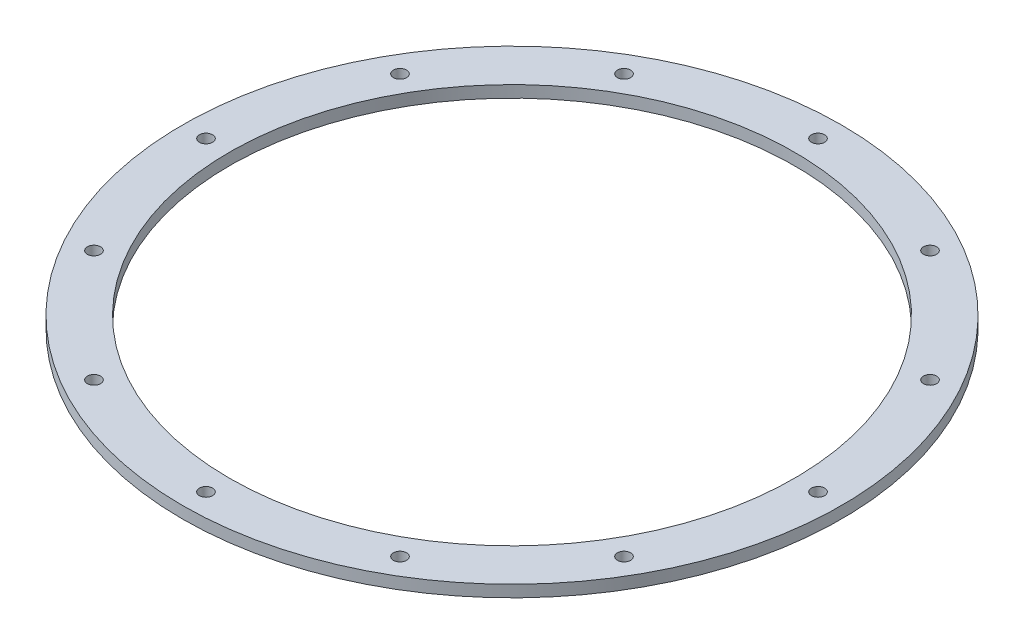
ISO-10303-21;
HEADER;
FILE_DESCRIPTION(('STEP AP214'),'2;1');
FILE_NAME('part.step','',(''),(''),'','','');
FILE_SCHEMA(('AUTOMOTIVE_DESIGN { 1 0 10303 214 1 1 1 1 }'));
ENDSEC;
DATA;
#1=APPLICATION_CONTEXT('core data for automotive mechanical design processes');
#2=APPLICATION_PROTOCOL_DEFINITION('international standard','automotive_design',2000,#1);
#3=PRODUCT_CONTEXT('',#1,'mechanical');
#4=PRODUCT('Part','Part','',(#3));
#5=PRODUCT_RELATED_PRODUCT_CATEGORY('part','',(#4));
#6=PRODUCT_DEFINITION_FORMATION('','',#4);
#7=PRODUCT_DEFINITION_CONTEXT('part definition',#1,'design');
#8=PRODUCT_DEFINITION('design','',#6,#7);
#9=PRODUCT_DEFINITION_SHAPE('','',#8);
#10=(LENGTH_UNIT() NAMED_UNIT(*) SI_UNIT(.MILLI.,.METRE.));
#11=(NAMED_UNIT(*) PLANE_ANGLE_UNIT() SI_UNIT($,.RADIAN.));
#12=(NAMED_UNIT(*) SI_UNIT($,.STERADIAN.) SOLID_ANGLE_UNIT());
#13=UNCERTAINTY_MEASURE_WITH_UNIT(LENGTH_MEASURE(1.E-05),#10,'distance_accuracy_value','');
#14=(GEOMETRIC_REPRESENTATION_CONTEXT(3) GLOBAL_UNCERTAINTY_ASSIGNED_CONTEXT((#13)) GLOBAL_UNIT_ASSIGNED_CONTEXT((#10,
#11,#12)) REPRESENTATION_CONTEXT('',''));
#15=CARTESIAN_POINT('',(0.,0.,0.));
#16=DIRECTION('',(0.,0.,1.));
#17=DIRECTION('',(1.,0.,0.));
#18=AXIS2_PLACEMENT_3D('',#15,#16,#17);
#19=CARTESIAN_POINT('',(0.,55.,0.));
#20=DIRECTION('',(0.,1.,0.));
#21=DIRECTION('',(0.,0.,1.));
#22=AXIS2_PLACEMENT_3D('',#19,#20,#21);
#23=CYLINDRICAL_SURFACE('',#22,38.1);
#24=CARTESIAN_POINT('',(0.,1.58750000000001,0.));
#25=DIRECTION('',(0.,1.,0.));
#26=DIRECTION('',(0.,0.,1.));
#27=AXIS2_PLACEMENT_3D('',#24,#25,#26);
#28=CIRCLE('',#27,38.1);
#29=CARTESIAN_POINT('',(0.,1.58750000000001,38.1));
#30=VERTEX_POINT('',#29);
#31=EDGE_CURVE('E10',#30,#30,#28,.T.);
#32=ORIENTED_EDGE('',*,*,#31,.T.);
#33=EDGE_LOOP('',(#32));
#34=FACE_BOUND('',#33,.T.);
#35=CARTESIAN_POINT('',(0.,0.,0.));
#36=DIRECTION('',(0.,1.,0.));
#37=DIRECTION('',(0.,0.,1.));
#38=AXIS2_PLACEMENT_3D('',#35,#36,#37);
#39=CIRCLE('',#38,38.1);
#40=CARTESIAN_POINT('',(0.,0.,38.1));
#41=VERTEX_POINT('',#40);
#42=EDGE_CURVE('E46',#41,#41,#39,.T.);
#43=ORIENTED_EDGE('',*,*,#42,.F.);
#44=EDGE_LOOP('',(#43));
#45=FACE_BOUND('',#44,.T.);
#46=ADVANCED_FACE('F32',(#34,#45),#23,.F.);
#47=CARTESIAN_POINT('',(-38.1,1.5875,0.));
#48=DIRECTION('',(0.,1.,0.));
#49=DIRECTION('',(0.,0.,1.));
#50=AXIS2_PLACEMENT_3D('',#47,#48,#49);
#51=PLANE('',#50);
#52=CARTESIAN_POINT('',(-35.7451985412029,1.5875,20.6374999999996));
#53=DIRECTION('',(0.,-1.,0.));
#54=DIRECTION('',(0.,0.,-1.));
#55=AXIS2_PLACEMENT_3D('',#52,#53,#54);
#56=CIRCLE('',#55,0.889000000000001);
#57=CARTESIAN_POINT('',(-35.7451985412029,1.5875,19.7484999999996));
#58=VERTEX_POINT('',#57);
#59=EDGE_CURVE('E117',#58,#58,#56,.T.);
#60=ORIENTED_EDGE('',*,*,#59,.T.);
#61=EDGE_LOOP('',(#60));
#62=FACE_BOUND('',#61,.T.);
#63=CARTESIAN_POINT('',(-20.6375000000004,1.5875,35.7451985412025));
#64=DIRECTION('',(0.,-1.,0.));
#65=DIRECTION('',(0.,0.,-1.));
#66=AXIS2_PLACEMENT_3D('',#63,#64,#65);
#67=CIRCLE('',#66,0.889000000000001);
#68=CARTESIAN_POINT('',(-20.6375000000004,1.5875,34.8561985412025));
#69=VERTEX_POINT('',#68);
#70=EDGE_CURVE('E111',#69,#69,#67,.T.);
#71=ORIENTED_EDGE('',*,*,#70,.T.);
#72=EDGE_LOOP('',(#71));
#73=FACE_BOUND('',#72,.T.);
#74=CARTESIAN_POINT('',(-3.53958818572525E-13,1.5875,41.275));
#75=DIRECTION('',(0.,-1.,0.));
#76=DIRECTION('',(0.,0.,-1.));
#77=AXIS2_PLACEMENT_3D('',#74,#75,#76);
#78=CIRCLE('',#77,0.889);
#79=CARTESIAN_POINT('',(-3.53958818572525E-13,1.5875,40.386));
#80=VERTEX_POINT('',#79);
#81=EDGE_CURVE('E105',#80,#80,#78,.T.);
#82=ORIENTED_EDGE('',*,*,#81,.T.);
#83=EDGE_LOOP('',(#82));
#84=FACE_BOUND('',#83,.T.);
#85=CARTESIAN_POINT('',(20.6374999999997,1.5875,35.7451985412029));
#86=DIRECTION('',(0.,-1.,0.));
#87=DIRECTION('',(0.,0.,-1.));
#88=AXIS2_PLACEMENT_3D('',#85,#86,#87);
#89=CIRCLE('',#88,0.889000000000001);
#90=CARTESIAN_POINT('',(20.6374999999997,1.5875,34.8561985412029));
#91=VERTEX_POINT('',#90);
#92=EDGE_CURVE('E99',#91,#91,#89,.T.);
#93=ORIENTED_EDGE('',*,*,#92,.T.);
#94=EDGE_LOOP('',(#93));
#95=FACE_BOUND('',#94,.T.);
#96=CARTESIAN_POINT('',(35.7451985412026,1.5875,20.6375000000002));
#97=DIRECTION('',(0.,-1.,0.));
#98=DIRECTION('',(0.,0.,-1.));
#99=AXIS2_PLACEMENT_3D('',#96,#97,#98);
#100=CIRCLE('',#99,0.889000000000001);
#101=CARTESIAN_POINT('',(35.7451985412026,1.5875,19.7485000000002));
#102=VERTEX_POINT('',#101);
#103=EDGE_CURVE('E93',#102,#102,#100,.T.);
#104=ORIENTED_EDGE('',*,*,#103,.T.);
#105=EDGE_LOOP('',(#104));
#106=FACE_BOUND('',#105,.T.);
#107=CARTESIAN_POINT('',(41.275,1.5875,2.28177708448336E-13));
#108=DIRECTION('',(0.,-1.,0.));
#109=DIRECTION('',(0.,0.,-1.));
#110=AXIS2_PLACEMENT_3D('',#107,#108,#109);
#111=CIRCLE('',#110,0.889000000000001);
#112=CARTESIAN_POINT('',(41.275,1.5875,-0.888999999999773));
#113=VERTEX_POINT('',#112);
#114=EDGE_CURVE('E87',#113,#113,#111,.T.);
#115=ORIENTED_EDGE('',*,*,#114,.T.);
#116=EDGE_LOOP('',(#115));
#117=FACE_BOUND('',#116,.T.);
#118=CARTESIAN_POINT('',(35.7451985412028,1.5875,-20.6374999999998));
#119=DIRECTION('',(0.,-1.,0.));
#120=DIRECTION('',(0.,0.,-1.));
#121=AXIS2_PLACEMENT_3D('',#118,#119,#120);
#122=CIRCLE('',#121,0.889000000000001);
#123=CARTESIAN_POINT('',(35.7451985412028,1.5875,-21.5264999999998));
#124=VERTEX_POINT('',#123);
#125=EDGE_CURVE('E81',#124,#124,#122,.T.);
#126=ORIENTED_EDGE('',*,*,#125,.T.);
#127=EDGE_LOOP('',(#126));
#128=FACE_BOUND('',#127,.T.);
#129=CARTESIAN_POINT('',(20.6375000000001,1.5875,-35.7451985412026));
#130=DIRECTION('',(0.,-1.,0.));
#131=DIRECTION('',(0.,0.,-1.));
#132=AXIS2_PLACEMENT_3D('',#129,#130,#131);
#133=CIRCLE('',#132,0.889000000000001);
#134=CARTESIAN_POINT('',(20.6375000000001,1.5875,-36.6341985412026));
#135=VERTEX_POINT('',#134);
#136=EDGE_CURVE('E75',#135,#135,#133,.T.);
#137=ORIENTED_EDGE('',*,*,#136,.T.);
#138=EDGE_LOOP('',(#137));
#139=FACE_BOUND('',#138,.T.);
#140=CARTESIAN_POINT('',(1.11561489392428E-13,1.5875,-41.275));
#141=DIRECTION('',(0.,-1.,0.));
#142=DIRECTION('',(0.,0.,-1.));
#143=AXIS2_PLACEMENT_3D('',#140,#141,#142);
#144=CIRCLE('',#143,0.889);
#145=CARTESIAN_POINT('',(1.11561489392428E-13,1.5875,-42.164));
#146=VERTEX_POINT('',#145);
#147=EDGE_CURVE('E69',#146,#146,#144,.T.);
#148=ORIENTED_EDGE('',*,*,#147,.T.);
#149=EDGE_LOOP('',(#148));
#150=FACE_BOUND('',#149,.T.);
#151=CARTESIAN_POINT('',(-20.6374999999999,1.5875,-35.7451985412027));
#152=DIRECTION('',(0.,-1.,0.));
#153=DIRECTION('',(0.,0.,-1.));
#154=AXIS2_PLACEMENT_3D('',#151,#152,#153);
#155=CIRCLE('',#154,0.889000000000001);
#156=CARTESIAN_POINT('',(-20.6374999999999,1.5875,-36.6341985412027));
#157=VERTEX_POINT('',#156);
#158=EDGE_CURVE('E63',#157,#157,#155,.T.);
#159=ORIENTED_EDGE('',*,*,#158,.T.);
#160=EDGE_LOOP('',(#159));
#161=FACE_BOUND('',#160,.T.);
#162=CARTESIAN_POINT('',(-35.7451985412027,1.5875,-20.6375));
#163=DIRECTION('',(0.,-1.,0.));
#164=DIRECTION('',(0.,0.,-1.));
#165=AXIS2_PLACEMENT_3D('',#162,#163,#164);
#166=CIRCLE('',#165,0.889000000000001);
#167=CARTESIAN_POINT('',(-35.7451985412027,1.5875,-21.5265));
#168=VERTEX_POINT('',#167);
#169=EDGE_CURVE('E57',#168,#168,#166,.T.);
#170=ORIENTED_EDGE('',*,*,#169,.T.);
#171=EDGE_LOOP('',(#170));
#172=FACE_BOUND('',#171,.T.);
#173=CARTESIAN_POINT('',(-41.275,1.5875,0.));
#174=DIRECTION('',(0.,-1.,0.));
#175=DIRECTION('',(0.,0.,-1.));
#176=AXIS2_PLACEMENT_3D('',#173,#174,#175);
#177=CIRCLE('',#176,0.889000000000001);
#178=CARTESIAN_POINT('',(-41.275,1.5875,-0.888999999999996));
#179=VERTEX_POINT('',#178);
#180=EDGE_CURVE('E51',#179,#179,#177,.T.);
#181=ORIENTED_EDGE('',*,*,#180,.T.);
#182=EDGE_LOOP('',(#181));
#183=FACE_BOUND('',#182,.T.);
#184=CARTESIAN_POINT('',(0.,1.58750000000001,0.));
#185=DIRECTION('',(0.,1.,0.));
#186=DIRECTION('',(0.,0.,1.));
#187=AXIS2_PLACEMENT_3D('',#184,#185,#186);
#188=CIRCLE('',#187,44.45);
#189=CARTESIAN_POINT('',(0.,1.58750000000001,44.45));
#190=VERTEX_POINT('',#189);
#191=EDGE_CURVE('E38',#190,#190,#188,.T.);
#192=ORIENTED_EDGE('',*,*,#191,.T.);
#193=EDGE_LOOP('',(#192));
#194=FACE_BOUND('',#193,.T.);
#195=ORIENTED_EDGE('',*,*,#31,.F.);
#196=EDGE_LOOP('',(#195));
#197=FACE_BOUND('',#196,.T.);
#198=ADVANCED_FACE('F160',(#62,#73,#84,#95,#106,#117,#128,#139,#150,#161,#172,#183,#194,#197),
#51,.T.);
#199=CARTESIAN_POINT('',(0.,55.,0.));
#200=DIRECTION('',(0.,1.,0.));
#201=DIRECTION('',(0.,0.,1.));
#202=AXIS2_PLACEMENT_3D('',#199,#200,#201);
#203=CYLINDRICAL_SURFACE('',#202,44.45);
#204=CARTESIAN_POINT('',(0.,0.,0.));
#205=DIRECTION('',(0.,1.,0.));
#206=DIRECTION('',(0.,0.,1.));
#207=AXIS2_PLACEMENT_3D('',#204,#205,#206);
#208=CIRCLE('',#207,44.45);
#209=CARTESIAN_POINT('',(0.,0.,44.45));
#210=VERTEX_POINT('',#209);
#211=EDGE_CURVE('E42',#210,#210,#208,.T.);
#212=ORIENTED_EDGE('',*,*,#211,.T.);
#213=EDGE_LOOP('',(#212));
#214=FACE_BOUND('',#213,.T.);
#215=ORIENTED_EDGE('',*,*,#191,.F.);
#216=EDGE_LOOP('',(#215));
#217=FACE_BOUND('',#216,.T.);
#218=ADVANCED_FACE('F130',(#214,#217),#203,.T.);
#219=CARTESIAN_POINT('',(-38.1,0.,0.));
#220=DIRECTION('',(0.,-1.,0.));
#221=DIRECTION('',(0.,0.,-1.));
#222=AXIS2_PLACEMENT_3D('',#219,#220,#221);
#223=PLANE('',#222);
#224=CARTESIAN_POINT('',(-35.7451985412029,0.,20.6374999999996));
#225=DIRECTION('',(0.,-1.,0.));
#226=DIRECTION('',(0.,0.,-1.));
#227=AXIS2_PLACEMENT_3D('',#224,#225,#226);
#228=CIRCLE('',#227,0.889000000000001);
#229=CARTESIAN_POINT('',(-35.7451985412029,0.,19.7484999999996));
#230=VERTEX_POINT('',#229);
#231=EDGE_CURVE('E120',#230,#230,#228,.T.);
#232=ORIENTED_EDGE('',*,*,#231,.F.);
#233=EDGE_LOOP('',(#232));
#234=FACE_BOUND('',#233,.T.);
#235=CARTESIAN_POINT('',(-20.6375000000004,0.,35.7451985412025));
#236=DIRECTION('',(0.,-1.,0.));
#237=DIRECTION('',(0.,0.,-1.));
#238=AXIS2_PLACEMENT_3D('',#235,#236,#237);
#239=CIRCLE('',#238,0.889000000000001);
#240=CARTESIAN_POINT('',(-20.6375000000004,0.,34.8561985412025));
#241=VERTEX_POINT('',#240);
#242=EDGE_CURVE('E114',#241,#241,#239,.T.);
#243=ORIENTED_EDGE('',*,*,#242,.F.);
#244=EDGE_LOOP('',(#243));
#245=FACE_BOUND('',#244,.T.);
#246=CARTESIAN_POINT('',(-3.53958818572525E-13,0.,41.275));
#247=DIRECTION('',(0.,-1.,0.));
#248=DIRECTION('',(0.,0.,-1.));
#249=AXIS2_PLACEMENT_3D('',#246,#247,#248);
#250=CIRCLE('',#249,0.889);
#251=CARTESIAN_POINT('',(-3.53958818572525E-13,0.,40.386));
#252=VERTEX_POINT('',#251);
#253=EDGE_CURVE('E108',#252,#252,#250,.T.);
#254=ORIENTED_EDGE('',*,*,#253,.F.);
#255=EDGE_LOOP('',(#254));
#256=FACE_BOUND('',#255,.T.);
#257=CARTESIAN_POINT('',(20.6374999999997,0.,35.7451985412029));
#258=DIRECTION('',(0.,-1.,0.));
#259=DIRECTION('',(0.,0.,-1.));
#260=AXIS2_PLACEMENT_3D('',#257,#258,#259);
#261=CIRCLE('',#260,0.889000000000001);
#262=CARTESIAN_POINT('',(20.6374999999997,0.,34.8561985412029));
#263=VERTEX_POINT('',#262);
#264=EDGE_CURVE('E102',#263,#263,#261,.T.);
#265=ORIENTED_EDGE('',*,*,#264,.F.);
#266=EDGE_LOOP('',(#265));
#267=FACE_BOUND('',#266,.T.);
#268=CARTESIAN_POINT('',(35.7451985412026,0.,20.6375000000002));
#269=DIRECTION('',(0.,-1.,0.));
#270=DIRECTION('',(0.,0.,-1.));
#271=AXIS2_PLACEMENT_3D('',#268,#269,#270);
#272=CIRCLE('',#271,0.889000000000001);
#273=CARTESIAN_POINT('',(35.7451985412026,0.,19.7485000000002));
#274=VERTEX_POINT('',#273);
#275=EDGE_CURVE('E96',#274,#274,#272,.T.);
#276=ORIENTED_EDGE('',*,*,#275,.F.);
#277=EDGE_LOOP('',(#276));
#278=FACE_BOUND('',#277,.T.);
#279=CARTESIAN_POINT('',(41.275,0.,2.28177708448336E-13));
#280=DIRECTION('',(0.,-1.,0.));
#281=DIRECTION('',(0.,0.,-1.));
#282=AXIS2_PLACEMENT_3D('',#279,#280,#281);
#283=CIRCLE('',#282,0.889000000000001);
#284=CARTESIAN_POINT('',(41.275,0.,-0.888999999999773));
#285=VERTEX_POINT('',#284);
#286=EDGE_CURVE('E90',#285,#285,#283,.T.);
#287=ORIENTED_EDGE('',*,*,#286,.F.);
#288=EDGE_LOOP('',(#287));
#289=FACE_BOUND('',#288,.T.);
#290=CARTESIAN_POINT('',(35.7451985412028,0.,-20.6374999999998));
#291=DIRECTION('',(0.,-1.,0.));
#292=DIRECTION('',(0.,0.,-1.));
#293=AXIS2_PLACEMENT_3D('',#290,#291,#292);
#294=CIRCLE('',#293,0.889000000000001);
#295=CARTESIAN_POINT('',(35.7451985412028,0.,-21.5264999999998));
#296=VERTEX_POINT('',#295);
#297=EDGE_CURVE('E84',#296,#296,#294,.T.);
#298=ORIENTED_EDGE('',*,*,#297,.F.);
#299=EDGE_LOOP('',(#298));
#300=FACE_BOUND('',#299,.T.);
#301=CARTESIAN_POINT('',(20.6375000000001,0.,-35.7451985412026));
#302=DIRECTION('',(0.,-1.,0.));
#303=DIRECTION('',(0.,0.,-1.));
#304=AXIS2_PLACEMENT_3D('',#301,#302,#303);
#305=CIRCLE('',#304,0.889000000000001);
#306=CARTESIAN_POINT('',(20.6375000000001,0.,-36.6341985412026));
#307=VERTEX_POINT('',#306);
#308=EDGE_CURVE('E78',#307,#307,#305,.T.);
#309=ORIENTED_EDGE('',*,*,#308,.F.);
#310=EDGE_LOOP('',(#309));
#311=FACE_BOUND('',#310,.T.);
#312=CARTESIAN_POINT('',(1.11561489392428E-13,0.,-41.275));
#313=DIRECTION('',(0.,-1.,0.));
#314=DIRECTION('',(0.,0.,-1.));
#315=AXIS2_PLACEMENT_3D('',#312,#313,#314);
#316=CIRCLE('',#315,0.889);
#317=CARTESIAN_POINT('',(1.11561489392428E-13,0.,-42.164));
#318=VERTEX_POINT('',#317);
#319=EDGE_CURVE('E72',#318,#318,#316,.T.);
#320=ORIENTED_EDGE('',*,*,#319,.F.);
#321=EDGE_LOOP('',(#320));
#322=FACE_BOUND('',#321,.T.);
#323=CARTESIAN_POINT('',(-20.6374999999999,0.,-35.7451985412027));
#324=DIRECTION('',(0.,-1.,0.));
#325=DIRECTION('',(0.,0.,-1.));
#326=AXIS2_PLACEMENT_3D('',#323,#324,#325);
#327=CIRCLE('',#326,0.889000000000001);
#328=CARTESIAN_POINT('',(-20.6374999999999,0.,-36.6341985412027));
#329=VERTEX_POINT('',#328);
#330=EDGE_CURVE('E66',#329,#329,#327,.T.);
#331=ORIENTED_EDGE('',*,*,#330,.F.);
#332=EDGE_LOOP('',(#331));
#333=FACE_BOUND('',#332,.T.);
#334=CARTESIAN_POINT('',(-35.7451985412027,0.,-20.6375));
#335=DIRECTION('',(0.,-1.,0.));
#336=DIRECTION('',(0.,0.,-1.));
#337=AXIS2_PLACEMENT_3D('',#334,#335,#336);
#338=CIRCLE('',#337,0.889000000000001);
#339=CARTESIAN_POINT('',(-35.7451985412027,0.,-21.5265));
#340=VERTEX_POINT('',#339);
#341=EDGE_CURVE('E60',#340,#340,#338,.T.);
#342=ORIENTED_EDGE('',*,*,#341,.F.);
#343=EDGE_LOOP('',(#342));
#344=FACE_BOUND('',#343,.T.);
#345=CARTESIAN_POINT('',(-41.275,0.,0.));
#346=DIRECTION('',(0.,-1.,0.));
#347=DIRECTION('',(0.,0.,-1.));
#348=AXIS2_PLACEMENT_3D('',#345,#346,#347);
#349=CIRCLE('',#348,0.889000000000001);
#350=CARTESIAN_POINT('',(-41.275,0.,-0.888999999999996));
#351=VERTEX_POINT('',#350);
#352=EDGE_CURVE('E54',#351,#351,#349,.T.);
#353=ORIENTED_EDGE('',*,*,#352,.F.);
#354=EDGE_LOOP('',(#353));
#355=FACE_BOUND('',#354,.T.);
#356=ORIENTED_EDGE('',*,*,#42,.T.);
#357=EDGE_LOOP('',(#356));
#358=FACE_BOUND('',#357,.T.);
#359=ORIENTED_EDGE('',*,*,#211,.F.);
#360=EDGE_LOOP('',(#359));
#361=FACE_BOUND('',#360,.T.);
#362=ADVANCED_FACE('F126',(#234,#245,#256,#267,#278,#289,#300,#311,#322,#333,#344,#355,#358,
#361),#223,.T.);
#363=CARTESIAN_POINT('',(-41.275,0.,0.));
#364=DIRECTION('',(0.,-1.,0.));
#365=DIRECTION('',(0.,0.,-1.));
#366=AXIS2_PLACEMENT_3D('',#363,#364,#365);
#367=CYLINDRICAL_SURFACE('',#366,0.889000000000001);
#368=ORIENTED_EDGE('',*,*,#180,.F.);
#369=EDGE_LOOP('',(#368));
#370=FACE_BOUND('',#369,.T.);
#371=ORIENTED_EDGE('',*,*,#352,.T.);
#372=EDGE_LOOP('',(#371));
#373=FACE_BOUND('',#372,.T.);
#374=ADVANCED_FACE('F129',(#370,#373),#367,.F.);
#375=CARTESIAN_POINT('',(-35.7451985412027,0.,-20.6375));
#376=DIRECTION('',(0.,-1.,0.));
#377=DIRECTION('',(0.,0.,-1.));
#378=AXIS2_PLACEMENT_3D('',#375,#376,#377);
#379=CYLINDRICAL_SURFACE('',#378,0.889000000000001);
#380=ORIENTED_EDGE('',*,*,#169,.F.);
#381=EDGE_LOOP('',(#380));
#382=FACE_BOUND('',#381,.T.);
#383=ORIENTED_EDGE('',*,*,#341,.T.);
#384=EDGE_LOOP('',(#383));
#385=FACE_BOUND('',#384,.T.);
#386=ADVANCED_FACE('F191',(#382,#385),#379,.F.);
#387=CARTESIAN_POINT('',(-20.6374999999999,0.,-35.7451985412027));
#388=DIRECTION('',(0.,-1.,0.));
#389=DIRECTION('',(0.,0.,-1.));
#390=AXIS2_PLACEMENT_3D('',#387,#388,#389);
#391=CYLINDRICAL_SURFACE('',#390,0.889000000000001);
#392=ORIENTED_EDGE('',*,*,#158,.F.);
#393=EDGE_LOOP('',(#392));
#394=FACE_BOUND('',#393,.T.);
#395=ORIENTED_EDGE('',*,*,#330,.T.);
#396=EDGE_LOOP('',(#395));
#397=FACE_BOUND('',#396,.T.);
#398=ADVANCED_FACE('F196',(#394,#397),#391,.F.);
#399=CARTESIAN_POINT('',(1.11561489392428E-13,0.,-41.275));
#400=DIRECTION('',(0.,-1.,0.));
#401=DIRECTION('',(0.,0.,-1.));
#402=AXIS2_PLACEMENT_3D('',#399,#400,#401);
#403=CYLINDRICAL_SURFACE('',#402,0.889);
#404=ORIENTED_EDGE('',*,*,#147,.F.);
#405=EDGE_LOOP('',(#404));
#406=FACE_BOUND('',#405,.T.);
#407=ORIENTED_EDGE('',*,*,#319,.T.);
#408=EDGE_LOOP('',(#407));
#409=FACE_BOUND('',#408,.T.);
#410=ADVANCED_FACE('F206',(#406,#409),#403,.F.);
#411=CARTESIAN_POINT('',(20.6375000000001,0.,-35.7451985412026));
#412=DIRECTION('',(0.,-1.,0.));
#413=DIRECTION('',(0.,0.,-1.));
#414=AXIS2_PLACEMENT_3D('',#411,#412,#413);
#415=CYLINDRICAL_SURFACE('',#414,0.889000000000001);
#416=ORIENTED_EDGE('',*,*,#136,.F.);
#417=EDGE_LOOP('',(#416));
#418=FACE_BOUND('',#417,.T.);
#419=ORIENTED_EDGE('',*,*,#308,.T.);
#420=EDGE_LOOP('',(#419));
#421=FACE_BOUND('',#420,.T.);
#422=ADVANCED_FACE('F216',(#418,#421),#415,.F.);
#423=CARTESIAN_POINT('',(35.7451985412028,0.,-20.6374999999998));
#424=DIRECTION('',(0.,-1.,0.));
#425=DIRECTION('',(0.,0.,-1.));
#426=AXIS2_PLACEMENT_3D('',#423,#424,#425);
#427=CYLINDRICAL_SURFACE('',#426,0.889000000000001);
#428=ORIENTED_EDGE('',*,*,#125,.F.);
#429=EDGE_LOOP('',(#428));
#430=FACE_BOUND('',#429,.T.);
#431=ORIENTED_EDGE('',*,*,#297,.T.);
#432=EDGE_LOOP('',(#431));
#433=FACE_BOUND('',#432,.T.);
#434=ADVANCED_FACE('F226',(#430,#433),#427,.F.);
#435=CARTESIAN_POINT('',(41.275,0.,2.28177708448336E-13));
#436=DIRECTION('',(0.,-1.,0.));
#437=DIRECTION('',(0.,0.,-1.));
#438=AXIS2_PLACEMENT_3D('',#435,#436,#437);
#439=CYLINDRICAL_SURFACE('',#438,0.889000000000001);
#440=ORIENTED_EDGE('',*,*,#114,.F.);
#441=EDGE_LOOP('',(#440));
#442=FACE_BOUND('',#441,.T.);
#443=ORIENTED_EDGE('',*,*,#286,.T.);
#444=EDGE_LOOP('',(#443));
#445=FACE_BOUND('',#444,.T.);
#446=ADVANCED_FACE('F236',(#442,#445),#439,.F.);
#447=CARTESIAN_POINT('',(35.7451985412026,0.,20.6375000000002));
#448=DIRECTION('',(0.,-1.,0.));
#449=DIRECTION('',(0.,0.,-1.));
#450=AXIS2_PLACEMENT_3D('',#447,#448,#449);
#451=CYLINDRICAL_SURFACE('',#450,0.889000000000001);
#452=ORIENTED_EDGE('',*,*,#103,.F.);
#453=EDGE_LOOP('',(#452));
#454=FACE_BOUND('',#453,.T.);
#455=ORIENTED_EDGE('',*,*,#275,.T.);
#456=EDGE_LOOP('',(#455));
#457=FACE_BOUND('',#456,.T.);
#458=ADVANCED_FACE('F246',(#454,#457),#451,.F.);
#459=CARTESIAN_POINT('',(20.6374999999997,0.,35.7451985412029));
#460=DIRECTION('',(0.,-1.,0.));
#461=DIRECTION('',(0.,0.,-1.));
#462=AXIS2_PLACEMENT_3D('',#459,#460,#461);
#463=CYLINDRICAL_SURFACE('',#462,0.889000000000001);
#464=ORIENTED_EDGE('',*,*,#92,.F.);
#465=EDGE_LOOP('',(#464));
#466=FACE_BOUND('',#465,.T.);
#467=ORIENTED_EDGE('',*,*,#264,.T.);
#468=EDGE_LOOP('',(#467));
#469=FACE_BOUND('',#468,.T.);
#470=ADVANCED_FACE('F256',(#466,#469),#463,.F.);
#471=CARTESIAN_POINT('',(-3.53958818572525E-13,0.,41.275));
#472=DIRECTION('',(0.,-1.,0.));
#473=DIRECTION('',(0.,0.,-1.));
#474=AXIS2_PLACEMENT_3D('',#471,#472,#473);
#475=CYLINDRICAL_SURFACE('',#474,0.889);
#476=ORIENTED_EDGE('',*,*,#81,.F.);
#477=EDGE_LOOP('',(#476));
#478=FACE_BOUND('',#477,.T.);
#479=ORIENTED_EDGE('',*,*,#253,.T.);
#480=EDGE_LOOP('',(#479));
#481=FACE_BOUND('',#480,.T.);
#482=ADVANCED_FACE('F266',(#478,#481),#475,.F.);
#483=CARTESIAN_POINT('',(-20.6375000000004,0.,35.7451985412025));
#484=DIRECTION('',(0.,-1.,0.));
#485=DIRECTION('',(0.,0.,-1.));
#486=AXIS2_PLACEMENT_3D('',#483,#484,#485);
#487=CYLINDRICAL_SURFACE('',#486,0.889000000000001);
#488=ORIENTED_EDGE('',*,*,#70,.F.);
#489=EDGE_LOOP('',(#488));
#490=FACE_BOUND('',#489,.T.);
#491=ORIENTED_EDGE('',*,*,#242,.T.);
#492=EDGE_LOOP('',(#491));
#493=FACE_BOUND('',#492,.T.);
#494=ADVANCED_FACE('F276',(#490,#493),#487,.F.);
#495=CARTESIAN_POINT('',(-35.7451985412029,0.,20.6374999999996));
#496=DIRECTION('',(0.,-1.,0.));
#497=DIRECTION('',(0.,0.,-1.));
#498=AXIS2_PLACEMENT_3D('',#495,#496,#497);
#499=CYLINDRICAL_SURFACE('',#498,0.889000000000001);
#500=ORIENTED_EDGE('',*,*,#59,.F.);
#501=EDGE_LOOP('',(#500));
#502=FACE_BOUND('',#501,.T.);
#503=ORIENTED_EDGE('',*,*,#231,.T.);
#504=EDGE_LOOP('',(#503));
#505=FACE_BOUND('',#504,.T.);
#506=ADVANCED_FACE('F124',(#502,#505),#499,.F.);
#507=CLOSED_SHELL('',(#46,#198,#218,#362,#374,#386,#398,#410,#422,#434,#446,#458,#470,#482,#494,#506));
#508=MANIFOLD_SOLID_BREP('B2',#507);
#509=ADVANCED_BREP_SHAPE_REPRESENTATION('',(#18,#508),#14);
#510=SHAPE_DEFINITION_REPRESENTATION(#9,#509);
ENDSEC;
END-ISO-10303-21;
